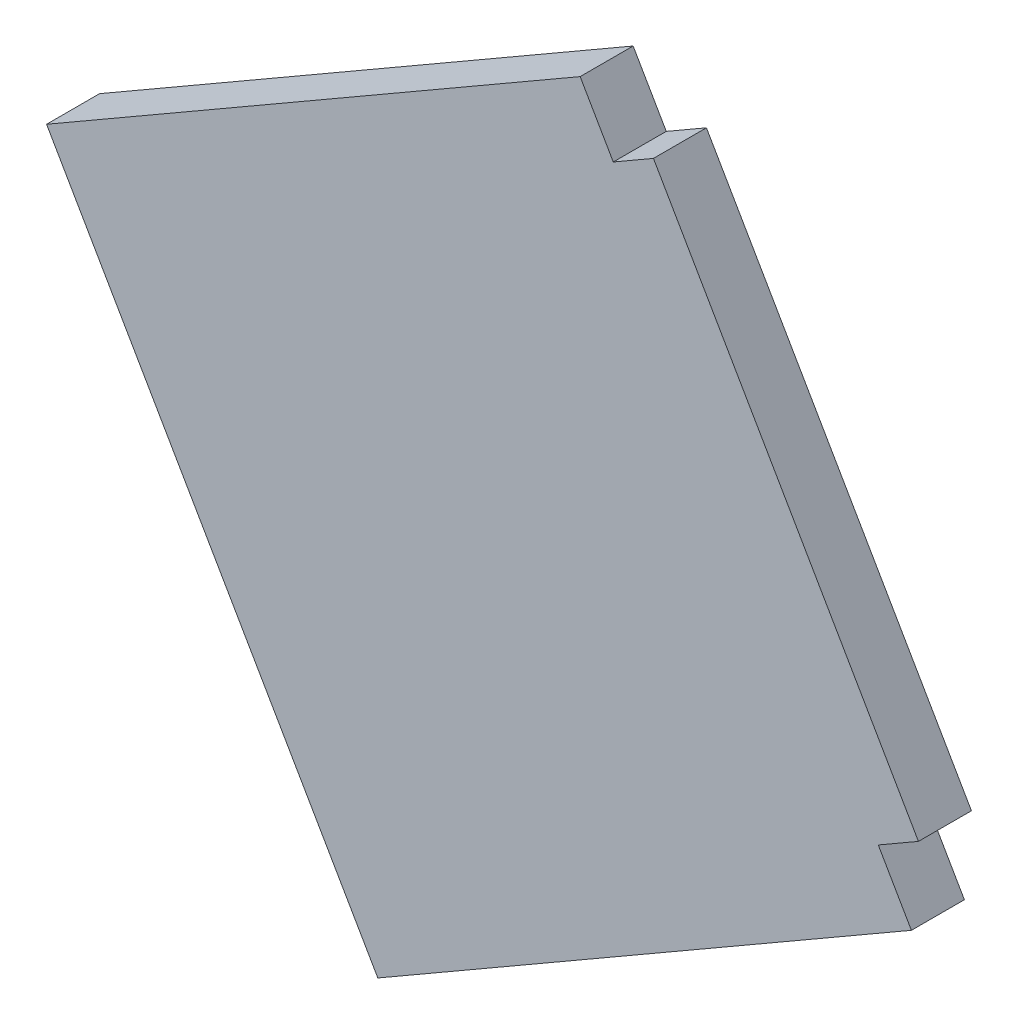
ISO-10303-21;
HEADER;
FILE_DESCRIPTION(('STEP AP214'),'2;1');
FILE_NAME('part.step','',(''),(''),'','','');
FILE_SCHEMA(('AUTOMOTIVE_DESIGN { 1 0 10303 214 1 1 1 1 }'));
ENDSEC;
DATA;
#1=APPLICATION_CONTEXT('core data for automotive mechanical design processes');
#2=APPLICATION_PROTOCOL_DEFINITION('international standard','automotive_design',2000,#1);
#3=PRODUCT_CONTEXT('',#1,'mechanical');
#4=PRODUCT('Part','Part','',(#3));
#5=PRODUCT_RELATED_PRODUCT_CATEGORY('part','',(#4));
#6=PRODUCT_DEFINITION_FORMATION('','',#4);
#7=PRODUCT_DEFINITION_CONTEXT('part definition',#1,'design');
#8=PRODUCT_DEFINITION('design','',#6,#7);
#9=PRODUCT_DEFINITION_SHAPE('','',#8);
#10=(LENGTH_UNIT() NAMED_UNIT(*) SI_UNIT(.MILLI.,.METRE.));
#11=(NAMED_UNIT(*) PLANE_ANGLE_UNIT() SI_UNIT($,.RADIAN.));
#12=(NAMED_UNIT(*) SI_UNIT($,.STERADIAN.) SOLID_ANGLE_UNIT());
#13=UNCERTAINTY_MEASURE_WITH_UNIT(LENGTH_MEASURE(1.E-05),#10,'distance_accuracy_value','');
#14=(GEOMETRIC_REPRESENTATION_CONTEXT(3) GLOBAL_UNCERTAINTY_ASSIGNED_CONTEXT((#13)) GLOBAL_UNIT_ASSIGNED_CONTEXT((#10,
#11,#12)) REPRESENTATION_CONTEXT('',''));
#15=CARTESIAN_POINT('',(0.,0.,0.));
#16=DIRECTION('',(0.,0.,1.));
#17=DIRECTION('',(1.,0.,0.));
#18=AXIS2_PLACEMENT_3D('',#15,#16,#17);
#19=CARTESIAN_POINT('',(0.2,-0.346410161513776,0.));
#20=DIRECTION('',(-0.5,0.866025403784438,0.));
#21=DIRECTION('',(-0.866025403784439,-0.5,0.));
#22=AXIS2_PLACEMENT_3D('',#19,#20,#21);
#23=PLANE('',#22);
#24=DIRECTION('',(-0.866025403784438,-0.5,0.));
#25=VECTOR('',#24,1.);
#26=CARTESIAN_POINT('',(0.2,-0.346410161513776,0.08));
#27=LINE('',#26,#25);
#28=CARTESIAN_POINT('',(-0.549999999999999,-0.779422863405995,0.08));
#29=VERTEX_POINT('',#28);
#30=CARTESIAN_POINT('',(-0.61062177826491,-0.814422863405995,0.08));
#31=VERTEX_POINT('',#30);
#32=EDGE_CURVE('E132',#29,#31,#27,.T.);
#33=ORIENTED_EDGE('',*,*,#32,.T.);
#34=DIRECTION('',(0.,0.,1.));
#35=VECTOR('',#34,1.);
#36=CARTESIAN_POINT('',(-0.61062177826491,-0.814422863405995,0.));
#37=LINE('',#36,#35);
#38=CARTESIAN_POINT('',(-0.61062177826491,-0.814422863405995,0.));
#39=VERTEX_POINT('',#38);
#40=EDGE_CURVE('E11',#39,#31,#37,.T.);
#41=ORIENTED_EDGE('',*,*,#40,.F.);
#42=DIRECTION('',(-0.866025403784438,-0.5,0.));
#43=VECTOR('',#42,1.);
#44=CARTESIAN_POINT('',(0.2,-0.346410161513776,0.));
#45=LINE('',#44,#43);
#46=CARTESIAN_POINT('',(-0.549999999999999,-0.779422863405995,0.));
#47=VERTEX_POINT('',#46);
#48=EDGE_CURVE('E53',#47,#39,#45,.T.);
#49=ORIENTED_EDGE('',*,*,#48,.F.);
#50=DIRECTION('',(0.,0.,1.));
#51=VECTOR('',#50,1.);
#52=CARTESIAN_POINT('',(-0.549999999999999,-0.779422863405995,0.));
#53=LINE('',#52,#51);
#54=EDGE_CURVE('E38',#47,#29,#53,.T.);
#55=ORIENTED_EDGE('',*,*,#54,.T.);
#56=EDGE_LOOP('',(#33,#41,#49,#55));
#57=FACE_BOUND('',#56,.T.);
#58=ADVANCED_FACE('F35',(#57),#23,.F.);
#59=CARTESIAN_POINT('',(-0.81062177826491,-0.46801270189222,0.));
#60=DIRECTION('',(0.866025403784438,0.500000000000001,0.));
#61=DIRECTION('',(-0.500000000000001,0.866025403784438,0.));
#62=AXIS2_PLACEMENT_3D('',#59,#60,#61);
#63=PLANE('',#62);
#64=DIRECTION('',(-0.500000000000001,0.866025403784438,0.));
#65=VECTOR('',#64,1.);
#66=CARTESIAN_POINT('',(-0.81062177826491,-0.46801270189222,0.08));
#67=LINE('',#66,#65);
#68=CARTESIAN_POINT('',(-0.56062177826491,-0.901025403784439,0.08));
#69=VERTEX_POINT('',#68);
#70=EDGE_CURVE('E148',#69,#31,#67,.T.);
#71=ORIENTED_EDGE('',*,*,#70,.F.);
#72=DIRECTION('',(0.,0.,1.));
#73=VECTOR('',#72,1.);
#74=CARTESIAN_POINT('',(-0.56062177826491,-0.901025403784439,0.));
#75=LINE('',#74,#73);
#76=CARTESIAN_POINT('',(-0.56062177826491,-0.901025403784439,0.));
#77=VERTEX_POINT('',#76);
#78=EDGE_CURVE('E44',#77,#69,#75,.T.);
#79=ORIENTED_EDGE('',*,*,#78,.F.);
#80=DIRECTION('',(-0.500000000000001,0.866025403784438,0.));
#81=VECTOR('',#80,1.);
#82=CARTESIAN_POINT('',(-0.81062177826491,-0.46801270189222,0.));
#83=LINE('',#82,#81);
#84=EDGE_CURVE('E112',#77,#39,#83,.T.);
#85=ORIENTED_EDGE('',*,*,#84,.T.);
#86=ORIENTED_EDGE('',*,*,#40,.T.);
#87=EDGE_LOOP('',(#71,#79,#85,#86));
#88=FACE_BOUND('',#87,.T.);
#89=ADVANCED_FACE('F165',(#88),#63,.T.);
#90=CARTESIAN_POINT('',(0.25,-0.433012701892219,0.));
#91=DIRECTION('',(-0.500000000000001,0.866025403784438,0.));
#92=DIRECTION('',(-0.866025403784438,-0.500000000000001,0.));
#93=AXIS2_PLACEMENT_3D('',#90,#91,#92);
#94=PLANE('',#93);
#95=DIRECTION('',(-0.866025403784438,-0.500000000000001,0.));
#96=VECTOR('',#95,1.);
#97=CARTESIAN_POINT('',(0.25,-0.433012701892219,0.08));
#98=LINE('',#97,#96);
#99=CARTESIAN_POINT('',(-1.36602540378444,-1.36602540378444,0.08));
#100=VERTEX_POINT('',#99);
#101=EDGE_CURVE('E117',#69,#100,#98,.T.);
#102=ORIENTED_EDGE('',*,*,#101,.T.);
#103=DIRECTION('',(0.,0.,1.));
#104=VECTOR('',#103,1.);
#105=CARTESIAN_POINT('',(-1.36602540378444,-1.36602540378444,0.));
#106=LINE('',#105,#104);
#107=CARTESIAN_POINT('',(-1.36602540378444,-1.36602540378444,0.));
#108=VERTEX_POINT('',#107);
#109=EDGE_CURVE('E115',#108,#100,#106,.T.);
#110=ORIENTED_EDGE('',*,*,#109,.F.);
#111=DIRECTION('',(-0.866025403784438,-0.500000000000001,0.));
#112=VECTOR('',#111,1.);
#113=CARTESIAN_POINT('',(0.25,-0.433012701892219,0.));
#114=LINE('',#113,#112);
#115=EDGE_CURVE('E105',#77,#108,#114,.T.);
#116=ORIENTED_EDGE('',*,*,#115,.F.);
#117=ORIENTED_EDGE('',*,*,#78,.T.);
#118=EDGE_LOOP('',(#102,#110,#116,#117));
#119=FACE_BOUND('',#118,.T.);
#120=ADVANCED_FACE('F116',(#119),#94,.F.);
#121=CARTESIAN_POINT('',(-1.61602540378444,-0.933012701892221,0.));
#122=DIRECTION('',(0.866025403784438,0.500000000000001,0.));
#123=DIRECTION('',(-0.500000000000001,0.866025403784438,0.));
#124=AXIS2_PLACEMENT_3D('',#121,#122,#123);
#125=PLANE('',#124);
#126=DIRECTION('',(-0.500000000000001,0.866025403784438,0.));
#127=VECTOR('',#126,1.);
#128=CARTESIAN_POINT('',(-1.61602540378444,-0.933012701892221,0.08));
#129=LINE('',#128,#127);
#130=CARTESIAN_POINT('',(-1.86602540378444,-0.500000000000002,0.08));
#131=VERTEX_POINT('',#130);
#132=EDGE_CURVE('E145',#100,#131,#129,.T.);
#133=ORIENTED_EDGE('',*,*,#132,.T.);
#134=DIRECTION('',(0.,0.,1.));
#135=VECTOR('',#134,1.);
#136=CARTESIAN_POINT('',(-1.86602540378444,-0.500000000000002,0.));
#137=LINE('',#136,#135);
#138=CARTESIAN_POINT('',(-1.86602540378444,-0.500000000000002,0.));
#139=VERTEX_POINT('',#138);
#140=EDGE_CURVE('E121',#139,#131,#137,.T.);
#141=ORIENTED_EDGE('',*,*,#140,.F.);
#142=DIRECTION('',(-0.500000000000001,0.866025403784438,0.));
#143=VECTOR('',#142,1.);
#144=CARTESIAN_POINT('',(-1.61602540378444,-0.933012701892221,0.));
#145=LINE('',#144,#143);
#146=EDGE_CURVE('E110',#108,#139,#145,.T.);
#147=ORIENTED_EDGE('',*,*,#146,.F.);
#148=ORIENTED_EDGE('',*,*,#109,.T.);
#149=EDGE_LOOP('',(#133,#141,#147,#148));
#150=FACE_BOUND('',#149,.T.);
#151=ADVANCED_FACE('F123',(#150),#125,.F.);
#152=CARTESIAN_POINT('',(-0.250000000000001,0.433012701892219,0.));
#153=DIRECTION('',(-0.500000000000001,0.866025403784438,0.));
#154=DIRECTION('',(-0.866025403784438,-0.500000000000001,0.));
#155=AXIS2_PLACEMENT_3D('',#152,#153,#154);
#156=PLANE('',#155);
#157=DIRECTION('',(-0.866025403784438,-0.500000000000001,0.));
#158=VECTOR('',#157,1.);
#159=CARTESIAN_POINT('',(-0.250000000000001,0.433012701892219,0.08));
#160=LINE('',#159,#158);
#161=CARTESIAN_POINT('',(-1.06062177826491,-0.035000000000001,0.08));
#162=VERTEX_POINT('',#161);
#163=EDGE_CURVE('E142',#162,#131,#160,.T.);
#164=ORIENTED_EDGE('',*,*,#163,.F.);
#165=DIRECTION('',(0.,0.,1.));
#166=VECTOR('',#165,1.);
#167=CARTESIAN_POINT('',(-1.06062177826491,-0.035000000000001,0.));
#168=LINE('',#167,#166);
#169=CARTESIAN_POINT('',(-1.06062177826491,-0.035000000000001,0.));
#170=VERTEX_POINT('',#169);
#171=EDGE_CURVE('E153',#170,#162,#168,.T.);
#172=ORIENTED_EDGE('',*,*,#171,.F.);
#173=DIRECTION('',(-0.866025403784438,-0.500000000000001,0.));
#174=VECTOR('',#173,1.);
#175=CARTESIAN_POINT('',(-0.250000000000001,0.433012701892219,0.));
#176=LINE('',#175,#174);
#177=EDGE_CURVE('E125',#170,#139,#176,.T.);
#178=ORIENTED_EDGE('',*,*,#177,.T.);
#179=ORIENTED_EDGE('',*,*,#140,.T.);
#180=EDGE_LOOP('',(#164,#172,#178,#179));
#181=FACE_BOUND('',#180,.T.);
#182=ADVANCED_FACE('F178',(#181),#156,.T.);
#183=CARTESIAN_POINT('',(-0.81062177826491,-0.46801270189222,0.));
#184=DIRECTION('',(-0.866025403784438,-0.500000000000001,0.));
#185=DIRECTION('',(0.500000000000001,-0.866025403784438,0.));
#186=AXIS2_PLACEMENT_3D('',#183,#184,#185);
#187=PLANE('',#186);
#188=DIRECTION('',(0.500000000000001,-0.866025403784438,0.));
#189=VECTOR('',#188,1.);
#190=CARTESIAN_POINT('',(-0.81062177826491,-0.46801270189222,0.08));
#191=LINE('',#190,#189);
#192=CARTESIAN_POINT('',(-1.01062177826491,-0.121602540378445,0.08));
#193=VERTEX_POINT('',#192);
#194=EDGE_CURVE('E139',#162,#193,#191,.T.);
#195=ORIENTED_EDGE('',*,*,#194,.T.);
#196=DIRECTION('',(0.,0.,1.));
#197=VECTOR('',#196,1.);
#198=CARTESIAN_POINT('',(-1.01062177826491,-0.121602540378445,0.));
#199=LINE('',#198,#197);
#200=CARTESIAN_POINT('',(-1.01062177826491,-0.121602540378445,0.));
#201=VERTEX_POINT('',#200);
#202=EDGE_CURVE('E155',#201,#193,#199,.T.);
#203=ORIENTED_EDGE('',*,*,#202,.F.);
#204=DIRECTION('',(0.500000000000001,-0.866025403784438,0.));
#205=VECTOR('',#204,1.);
#206=CARTESIAN_POINT('',(-0.81062177826491,-0.46801270189222,0.));
#207=LINE('',#206,#205);
#208=EDGE_CURVE('E127',#170,#201,#207,.T.);
#209=ORIENTED_EDGE('',*,*,#208,.F.);
#210=ORIENTED_EDGE('',*,*,#171,.T.);
#211=EDGE_LOOP('',(#195,#203,#209,#210));
#212=FACE_BOUND('',#211,.T.);
#213=ADVANCED_FACE('F181',(#212),#187,.F.);
#214=CARTESIAN_POINT('',(-0.199999999999999,0.346410161513775,0.));
#215=DIRECTION('',(-0.5,0.866025403784439,0.));
#216=DIRECTION('',(-0.866025403784439,-0.5,0.));
#217=AXIS2_PLACEMENT_3D('',#214,#215,#216);
#218=PLANE('',#217);
#219=DIRECTION('',(-0.866025403784439,-0.5,0.));
#220=VECTOR('',#219,1.);
#221=CARTESIAN_POINT('',(-0.199999999999999,0.346410161513775,0.08));
#222=LINE('',#221,#220);
#223=CARTESIAN_POINT('',(-0.949999999999999,-0.0866025403784445,0.08));
#224=VERTEX_POINT('',#223);
#225=EDGE_CURVE('E136',#224,#193,#222,.T.);
#226=ORIENTED_EDGE('',*,*,#225,.F.);
#227=DIRECTION('',(0.,0.,1.));
#228=VECTOR('',#227,1.);
#229=CARTESIAN_POINT('',(-0.949999999999999,-0.0866025403784445,0.));
#230=LINE('',#229,#228);
#231=CARTESIAN_POINT('',(-0.949999999999999,-0.0866025403784445,0.));
#232=VERTEX_POINT('',#231);
#233=EDGE_CURVE('E156',#232,#224,#230,.T.);
#234=ORIENTED_EDGE('',*,*,#233,.F.);
#235=DIRECTION('',(-0.866025403784439,-0.5,0.));
#236=VECTOR('',#235,1.);
#237=CARTESIAN_POINT('',(-0.199999999999999,0.346410161513775,0.));
#238=LINE('',#237,#236);
#239=EDGE_CURVE('E259',#232,#201,#238,.T.);
#240=ORIENTED_EDGE('',*,*,#239,.T.);
#241=ORIENTED_EDGE('',*,*,#202,.T.);
#242=EDGE_LOOP('',(#226,#234,#240,#241));
#243=FACE_BOUND('',#242,.T.);
#244=ADVANCED_FACE('F185',(#243),#218,.T.);
#245=CARTESIAN_POINT('',(-0.749999999999999,-0.433012701892219,0.));
#246=DIRECTION('',(-0.866025403784438,-0.5,0.));
#247=DIRECTION('',(0.5,-0.866025403784438,0.));
#248=AXIS2_PLACEMENT_3D('',#245,#246,#247);
#249=PLANE('',#248);
#250=DIRECTION('',(0.5,-0.866025403784438,0.));
#251=VECTOR('',#250,1.);
#252=CARTESIAN_POINT('',(-0.749999999999999,-0.433012701892219,0.08));
#253=LINE('',#252,#251);
#254=EDGE_CURVE('E134',#224,#29,#253,.T.);
#255=ORIENTED_EDGE('',*,*,#254,.T.);
#256=ORIENTED_EDGE('',*,*,#54,.F.);
#257=DIRECTION('',(0.5,-0.866025403784438,0.));
#258=VECTOR('',#257,1.);
#259=CARTESIAN_POINT('',(-0.749999999999999,-0.433012701892219,0.));
#260=LINE('',#259,#258);
#261=EDGE_CURVE('E91',#232,#47,#260,.T.);
#262=ORIENTED_EDGE('',*,*,#261,.F.);
#263=ORIENTED_EDGE('',*,*,#233,.T.);
#264=EDGE_LOOP('',(#255,#256,#262,#263));
#265=FACE_BOUND('',#264,.T.);
#266=ADVANCED_FACE('F188',(#265),#249,.F.);
#267=CARTESIAN_POINT('',(0.,0.,0.));
#268=DIRECTION('',(0.,0.,1.));
#269=DIRECTION('',(1.,0.,0.));
#270=AXIS2_PLACEMENT_3D('',#267,#268,#269);
#271=PLANE('',#270);
#272=ORIENTED_EDGE('',*,*,#48,.T.);
#273=ORIENTED_EDGE('',*,*,#84,.F.);
#274=ORIENTED_EDGE('',*,*,#115,.T.);
#275=ORIENTED_EDGE('',*,*,#146,.T.);
#276=ORIENTED_EDGE('',*,*,#177,.F.);
#277=ORIENTED_EDGE('',*,*,#208,.T.);
#278=ORIENTED_EDGE('',*,*,#239,.F.);
#279=ORIENTED_EDGE('',*,*,#261,.T.);
#280=EDGE_LOOP('',(#272,#273,#274,#275,#276,#277,#278,#279));
#281=FACE_BOUND('',#280,.T.);
#282=ADVANCED_FACE('F107',(#281),#271,.F.);
#283=CARTESIAN_POINT('',(0.,0.,0.08));
#284=DIRECTION('',(0.,0.,1.));
#285=DIRECTION('',(1.,0.,0.));
#286=AXIS2_PLACEMENT_3D('',#283,#284,#285);
#287=PLANE('',#286);
#288=ORIENTED_EDGE('',*,*,#32,.F.);
#289=ORIENTED_EDGE('',*,*,#254,.F.);
#290=ORIENTED_EDGE('',*,*,#225,.T.);
#291=ORIENTED_EDGE('',*,*,#194,.F.);
#292=ORIENTED_EDGE('',*,*,#163,.T.);
#293=ORIENTED_EDGE('',*,*,#132,.F.);
#294=ORIENTED_EDGE('',*,*,#101,.F.);
#295=ORIENTED_EDGE('',*,*,#70,.T.);
#296=EDGE_LOOP('',(#288,#289,#290,#291,#292,#293,#294,#295));
#297=FACE_BOUND('',#296,.T.);
#298=ADVANCED_FACE('F163',(#297),#287,.T.);
#299=CLOSED_SHELL('',(#58,#89,#120,#151,#182,#213,#244,#266,#282,#298));
#300=MANIFOLD_SOLID_BREP('B2',#299);
#301=ADVANCED_BREP_SHAPE_REPRESENTATION('',(#18,#300),#14);
#302=SHAPE_DEFINITION_REPRESENTATION(#9,#301);
ENDSEC;
END-ISO-10303-21;
